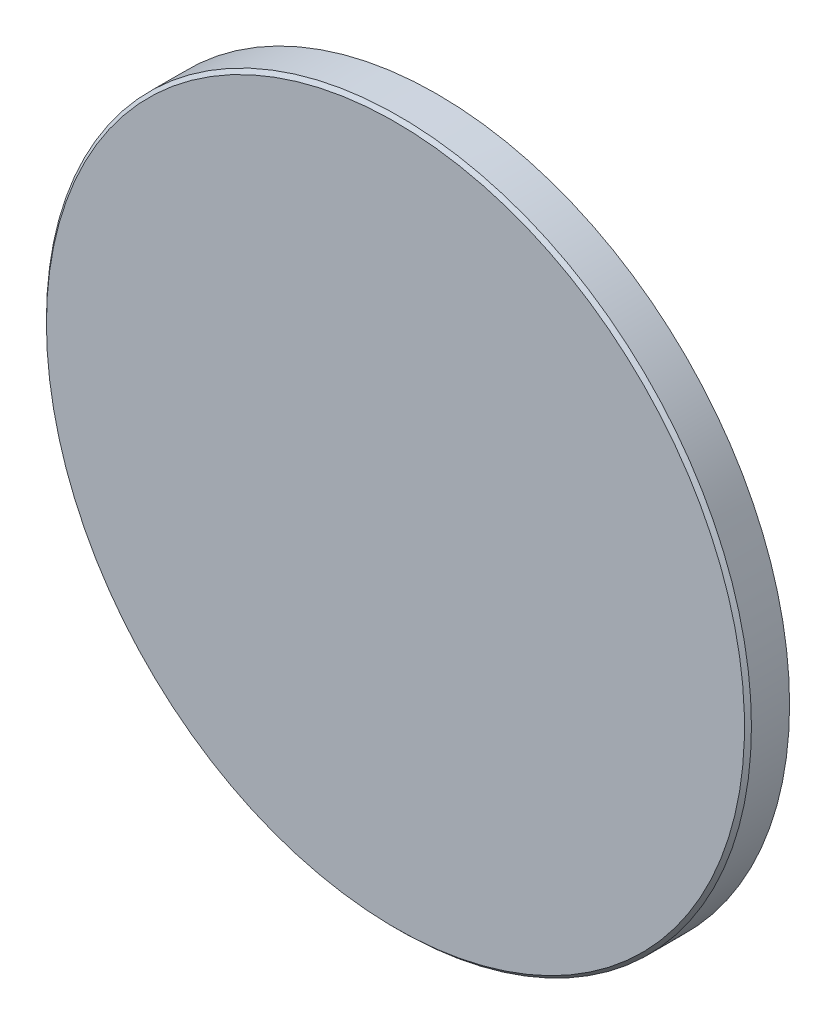
ISO-10303-21;
HEADER;
FILE_DESCRIPTION(('STEP AP214'),'2;1');
FILE_NAME('part.step','',(''),(''),'','','');
FILE_SCHEMA(('AUTOMOTIVE_DESIGN { 1 0 10303 214 1 1 1 1 }'));
ENDSEC;
DATA;
#1=APPLICATION_CONTEXT('core data for automotive mechanical design processes');
#2=APPLICATION_PROTOCOL_DEFINITION('international standard','automotive_design',2000,#1);
#3=PRODUCT_CONTEXT('',#1,'mechanical');
#4=PRODUCT('Part','Part','',(#3));
#5=PRODUCT_RELATED_PRODUCT_CATEGORY('part','',(#4));
#6=PRODUCT_DEFINITION_FORMATION('','',#4);
#7=PRODUCT_DEFINITION_CONTEXT('part definition',#1,'design');
#8=PRODUCT_DEFINITION('design','',#6,#7);
#9=PRODUCT_DEFINITION_SHAPE('','',#8);
#10=(LENGTH_UNIT() NAMED_UNIT(*) SI_UNIT(.MILLI.,.METRE.));
#11=(NAMED_UNIT(*) PLANE_ANGLE_UNIT() SI_UNIT($,.RADIAN.));
#12=(NAMED_UNIT(*) SI_UNIT($,.STERADIAN.) SOLID_ANGLE_UNIT());
#13=UNCERTAINTY_MEASURE_WITH_UNIT(LENGTH_MEASURE(1.E-05),#10,'distance_accuracy_value','');
#14=(GEOMETRIC_REPRESENTATION_CONTEXT(3) GLOBAL_UNCERTAINTY_ASSIGNED_CONTEXT((#13)) GLOBAL_UNIT_ASSIGNED_CONTEXT((#10,
#11,#12)) REPRESENTATION_CONTEXT('',''));
#15=CARTESIAN_POINT('',(0.,0.,0.));
#16=DIRECTION('',(0.,0.,1.));
#17=DIRECTION('',(1.,0.,0.));
#18=AXIS2_PLACEMENT_3D('',#15,#16,#17);
#19=CARTESIAN_POINT('',(0.,0.,0.));
#20=DIRECTION('',(0.,0.,-1.));
#21=DIRECTION('',(-1.,0.,0.));
#22=AXIS2_PLACEMENT_3D('',#19,#20,#21);
#23=PLANE('',#22);
#24=CARTESIAN_POINT('',(0.,0.,0.));
#25=DIRECTION('',(0.,0.,-1.));
#26=DIRECTION('',(-1.,0.,0.));
#27=AXIS2_PLACEMENT_3D('',#24,#25,#26);
#28=CIRCLE('',#27,25.15);
#29=CARTESIAN_POINT('',(-25.15,0.,0.));
#30=VERTEX_POINT('',#29);
#31=EDGE_CURVE('E20',#30,#30,#28,.F.);
#32=ORIENTED_EDGE('',*,*,#31,.T.);
#33=EDGE_LOOP('',(#32));
#34=FACE_BOUND('',#33,.T.);
#35=ADVANCED_FACE('F13',(#34),#23,.F.);
#36=CARTESIAN_POINT('',(0.,0.,0.));
#37=DIRECTION('',(0.,0.,1.));
#38=DIRECTION('',(1.,0.,0.));
#39=AXIS2_PLACEMENT_3D('',#36,#37,#38);
#40=CYLINDRICAL_SURFACE('',#39,25.4);
#41=CARTESIAN_POINT('',(0.,0.,-0.249999999999966));
#42=DIRECTION('',(0.,0.,-1.));
#43=DIRECTION('',(-1.,0.,0.));
#44=AXIS2_PLACEMENT_3D('',#41,#42,#43);
#45=CIRCLE('',#44,25.4);
#46=CARTESIAN_POINT('',(-25.4,0.,-0.249999999999966));
#47=VERTEX_POINT('',#46);
#48=EDGE_CURVE('E9',#47,#47,#45,.T.);
#49=ORIENTED_EDGE('',*,*,#48,.T.);
#50=EDGE_LOOP('',(#49));
#51=FACE_BOUND('',#50,.T.);
#52=CARTESIAN_POINT('',(0.,0.,-2.99910810657181));
#53=DIRECTION('',(0.,0.,1.));
#54=DIRECTION('',(1.,0.,0.));
#55=AXIS2_PLACEMENT_3D('',#52,#53,#54);
#56=CIRCLE('',#55,25.4);
#57=CARTESIAN_POINT('',(25.4,0.,-2.99910810657181));
#58=VERTEX_POINT('',#57);
#59=EDGE_CURVE('E24',#58,#58,#56,.T.);
#60=ORIENTED_EDGE('',*,*,#59,.T.);
#61=EDGE_LOOP('',(#60));
#62=FACE_BOUND('',#61,.T.);
#63=ADVANCED_FACE('F31',(#51,#62),#40,.T.);
#64=CARTESIAN_POINT('',(0.,0.,79.97));
#65=DIRECTION('',(0.,0.,1.));
#66=DIRECTION('',(0.,1.,0.));
#67=AXIS2_PLACEMENT_3D('',#64,#65,#66);
#68=SPHERICAL_SURFACE('',#67,86.77);
#69=ORIENTED_EDGE('',*,*,#59,.F.);
#70=EDGE_LOOP('',(#69));
#71=FACE_BOUND('',#70,.T.);
#72=ADVANCED_FACE('F33',(#71),#68,.T.);
#73=CARTESIAN_POINT('',(0.,0.,0.));
#74=DIRECTION('',(0.,0.,-1.));
#75=DIRECTION('',(-1.,0.,0.));
#76=AXIS2_PLACEMENT_3D('',#73,#74,#75);
#77=CONICAL_SURFACE('',#76,25.15,0.785398163397455);
#78=ORIENTED_EDGE('',*,*,#48,.F.);
#79=EDGE_LOOP('',(#78));
#80=FACE_BOUND('',#79,.T.);
#81=ORIENTED_EDGE('',*,*,#31,.F.);
#82=EDGE_LOOP('',(#81));
#83=FACE_BOUND('',#82,.T.);
#84=ADVANCED_FACE('F15',(#80,#83),#77,.T.);
#85=CLOSED_SHELL('',(#35,#63,#72,#84));
#86=MANIFOLD_SOLID_BREP('B1',#85);
#87=ADVANCED_BREP_SHAPE_REPRESENTATION('',(#18,#86),#14);
#88=SHAPE_DEFINITION_REPRESENTATION(#9,#87);
ENDSEC;
END-ISO-10303-21;
